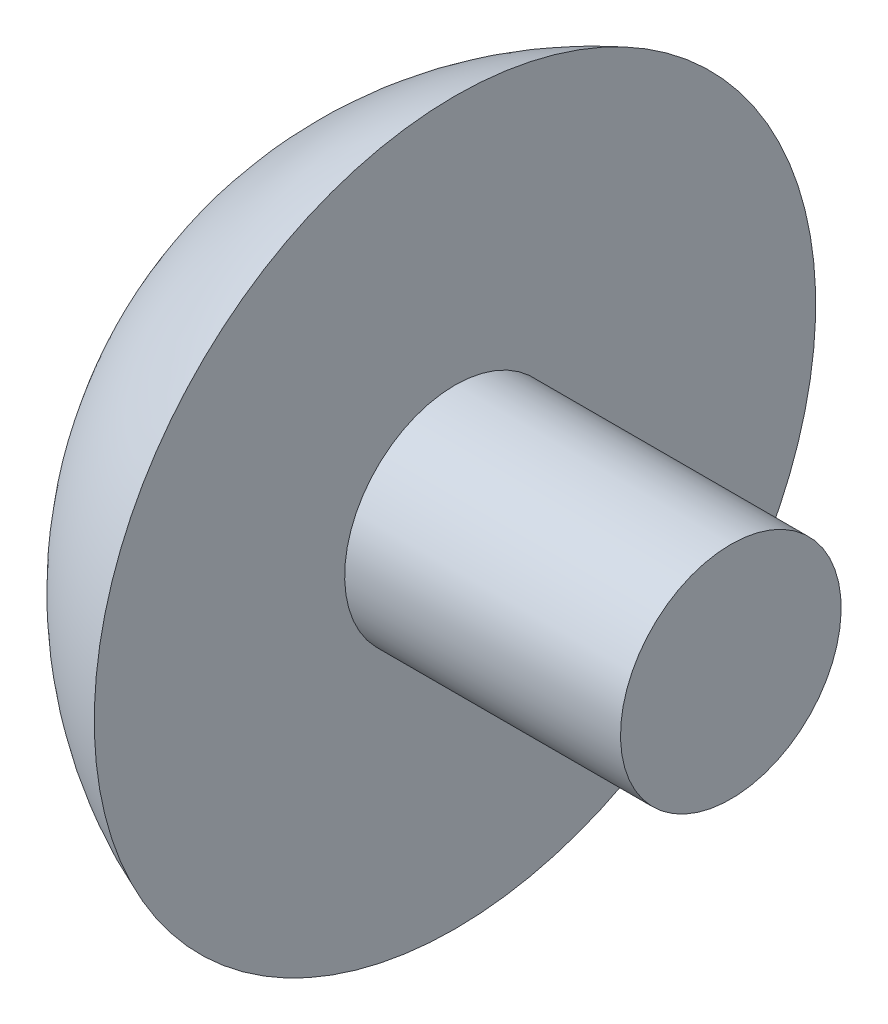
ISO-10303-21;
HEADER;
FILE_DESCRIPTION(('STEP AP214'),'2;1');
FILE_NAME('part.step','',(''),(''),'','','');
FILE_SCHEMA(('AUTOMOTIVE_DESIGN { 1 0 10303 214 1 1 1 1 }'));
ENDSEC;
DATA;
#1=APPLICATION_CONTEXT('core data for automotive mechanical design processes');
#2=APPLICATION_PROTOCOL_DEFINITION('international standard','automotive_design',2000,#1);
#3=PRODUCT_CONTEXT('',#1,'mechanical');
#4=PRODUCT('Part','Part','',(#3));
#5=PRODUCT_RELATED_PRODUCT_CATEGORY('part','',(#4));
#6=PRODUCT_DEFINITION_FORMATION('','',#4);
#7=PRODUCT_DEFINITION_CONTEXT('part definition',#1,'design');
#8=PRODUCT_DEFINITION('design','',#6,#7);
#9=PRODUCT_DEFINITION_SHAPE('','',#8);
#10=(LENGTH_UNIT() NAMED_UNIT(*) SI_UNIT(.MILLI.,.METRE.));
#11=(NAMED_UNIT(*) PLANE_ANGLE_UNIT() SI_UNIT($,.RADIAN.));
#12=(NAMED_UNIT(*) SI_UNIT($,.STERADIAN.) SOLID_ANGLE_UNIT());
#13=UNCERTAINTY_MEASURE_WITH_UNIT(LENGTH_MEASURE(1.E-05),#10,'distance_accuracy_value','');
#14=(GEOMETRIC_REPRESENTATION_CONTEXT(3) GLOBAL_UNCERTAINTY_ASSIGNED_CONTEXT((#13)) GLOBAL_UNIT_ASSIGNED_CONTEXT((#10,
#11,#12)) REPRESENTATION_CONTEXT('',''));
#15=CARTESIAN_POINT('',(0.,0.,0.));
#16=DIRECTION('',(0.,0.,1.));
#17=DIRECTION('',(1.,0.,0.));
#18=AXIS2_PLACEMENT_3D('',#15,#16,#17);
#19=CARTESIAN_POINT('',(0.,0.,0.));
#20=DIRECTION('',(-1.,0.,0.));
#21=DIRECTION('',(0.,-1.,0.));
#22=AXIS2_PLACEMENT_3D('',#19,#20,#21);
#23=PLANE('',#22);
#24=CARTESIAN_POINT('',(0.,0.,0.));
#25=DIRECTION('',(1.,0.,0.));
#26=DIRECTION('',(0.,1.,0.));
#27=AXIS2_PLACEMENT_3D('',#24,#25,#26);
#28=CIRCLE('',#27,2.);
#29=CARTESIAN_POINT('',(0.,2.,0.));
#30=VERTEX_POINT('',#29);
#31=EDGE_CURVE('E41',#30,#30,#28,.T.);
#32=ORIENTED_EDGE('',*,*,#31,.T.);
#33=EDGE_LOOP('',(#32));
#34=FACE_BOUND('',#33,.T.);
#35=ADVANCED_FACE('F31',(#34),#23,.F.);
#36=CARTESIAN_POINT('',(-2.5,0.,0.));
#37=DIRECTION('',(1.,0.,0.));
#38=DIRECTION('',(0.,-1.,0.));
#39=AXIS2_PLACEMENT_3D('',#36,#37,#38);
#40=SPHERICAL_SURFACE('',#39,7.);
#41=CARTESIAN_POINT('',(-5.00000000000001,0.,0.));
#42=DIRECTION('',(1.,0.,0.));
#43=DIRECTION('',(0.,1.,0.));
#44=AXIS2_PLACEMENT_3D('',#41,#42,#43);
#45=CIRCLE('',#44,6.53834841531101);
#46=CARTESIAN_POINT('',(-5.00000000000001,6.53834841531101,0.));
#47=VERTEX_POINT('',#46);
#48=EDGE_CURVE('E10',#47,#47,#45,.T.);
#49=ORIENTED_EDGE('',*,*,#48,.F.);
#50=EDGE_LOOP('',(#49));
#51=FACE_BOUND('',#50,.T.);
#52=ADVANCED_FACE('F56',(#51),#40,.T.);
#53=CARTESIAN_POINT('',(-5.,-2.,0.));
#54=DIRECTION('',(-1.,0.,0.));
#55=DIRECTION('',(0.,-1.,0.));
#56=AXIS2_PLACEMENT_3D('',#53,#54,#55);
#57=PLANE('',#56);
#58=CARTESIAN_POINT('',(-5.,0.,0.));
#59=DIRECTION('',(1.,0.,0.));
#60=DIRECTION('',(0.,1.,0.));
#61=AXIS2_PLACEMENT_3D('',#58,#59,#60);
#62=CIRCLE('',#61,2.);
#63=CARTESIAN_POINT('',(-5.,2.,0.));
#64=VERTEX_POINT('',#63);
#65=EDGE_CURVE('E37',#64,#64,#62,.T.);
#66=ORIENTED_EDGE('',*,*,#65,.F.);
#67=EDGE_LOOP('',(#66));
#68=FACE_BOUND('',#67,.T.);
#69=ORIENTED_EDGE('',*,*,#48,.T.);
#70=EDGE_LOOP('',(#69));
#71=FACE_BOUND('',#70,.T.);
#72=ADVANCED_FACE('F51',(#68,#71),#57,.F.);
#73=CARTESIAN_POINT('',(0.,0.,0.));
#74=DIRECTION('',(1.,0.,0.));
#75=DIRECTION('',(0.,1.,0.));
#76=AXIS2_PLACEMENT_3D('',#73,#74,#75);
#77=CYLINDRICAL_SURFACE('',#76,2.);
#78=ORIENTED_EDGE('',*,*,#31,.F.);
#79=EDGE_LOOP('',(#78));
#80=FACE_BOUND('',#79,.T.);
#81=ORIENTED_EDGE('',*,*,#65,.T.);
#82=EDGE_LOOP('',(#81));
#83=FACE_BOUND('',#82,.T.);
#84=ADVANCED_FACE('F49',(#80,#83),#77,.T.);
#85=CLOSED_SHELL('',(#35,#52,#72,#84));
#86=MANIFOLD_SOLID_BREP('B2',#85);
#87=ADVANCED_BREP_SHAPE_REPRESENTATION('',(#18,#86),#14);
#88=SHAPE_DEFINITION_REPRESENTATION(#9,#87);
ENDSEC;
END-ISO-10303-21;
